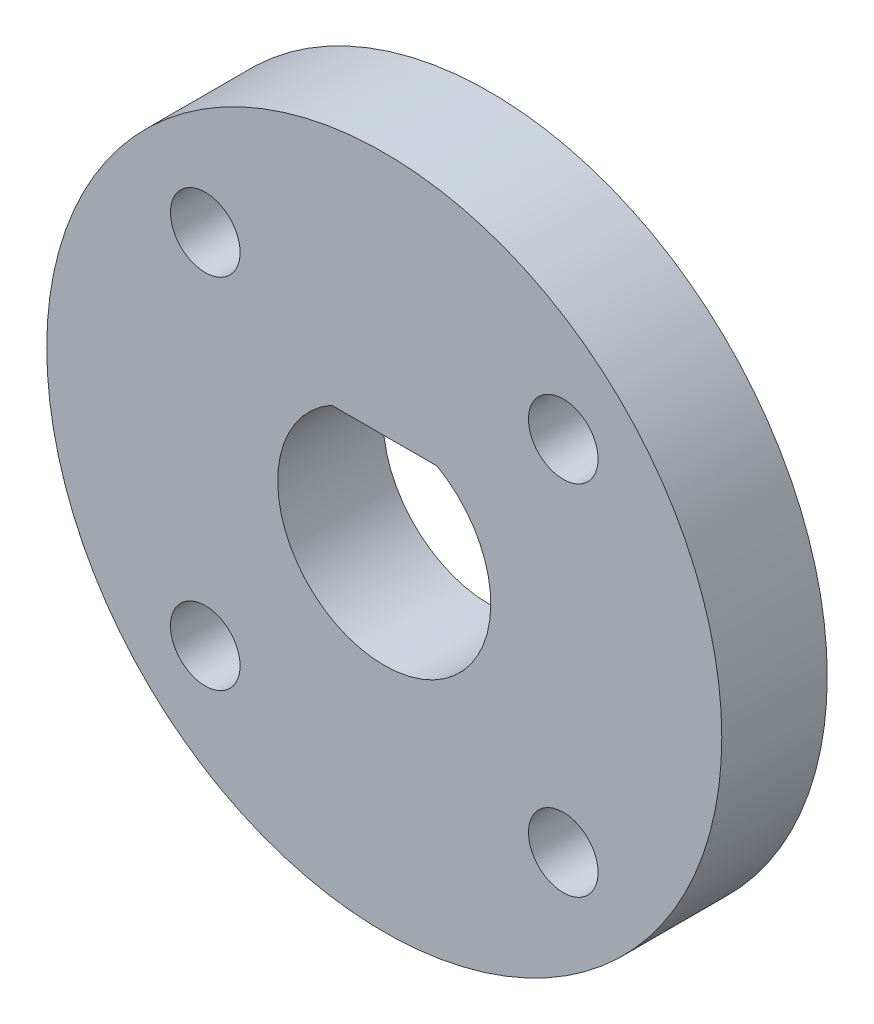
ISO-10303-21;
HEADER;
FILE_DESCRIPTION(('STEP AP214'),'2;1');
FILE_NAME('part.step','',(''),(''),'','','');
FILE_SCHEMA(('AUTOMOTIVE_DESIGN { 1 0 10303 214 1 1 1 1 }'));
ENDSEC;
DATA;
#1=APPLICATION_CONTEXT('core data for automotive mechanical design processes');
#2=APPLICATION_PROTOCOL_DEFINITION('international standard','automotive_design',2000,#1);
#3=PRODUCT_CONTEXT('',#1,'mechanical');
#4=PRODUCT('Part','Part','',(#3));
#5=PRODUCT_RELATED_PRODUCT_CATEGORY('part','',(#4));
#6=PRODUCT_DEFINITION_FORMATION('','',#4);
#7=PRODUCT_DEFINITION_CONTEXT('part definition',#1,'design');
#8=PRODUCT_DEFINITION('design','',#6,#7);
#9=PRODUCT_DEFINITION_SHAPE('','',#8);
#10=(LENGTH_UNIT() NAMED_UNIT(*) SI_UNIT(.MILLI.,.METRE.));
#11=(NAMED_UNIT(*) PLANE_ANGLE_UNIT() SI_UNIT($,.RADIAN.));
#12=(NAMED_UNIT(*) SI_UNIT($,.STERADIAN.) SOLID_ANGLE_UNIT());
#13=UNCERTAINTY_MEASURE_WITH_UNIT(LENGTH_MEASURE(1.E-05),#10,'distance_accuracy_value','');
#14=(GEOMETRIC_REPRESENTATION_CONTEXT(3) GLOBAL_UNCERTAINTY_ASSIGNED_CONTEXT((#13)) GLOBAL_UNIT_ASSIGNED_CONTEXT((#10,
#11,#12)) REPRESENTATION_CONTEXT('',''));
#15=CARTESIAN_POINT('',(0.,0.,0.));
#16=DIRECTION('',(0.,0.,1.));
#17=DIRECTION('',(1.,0.,0.));
#18=AXIS2_PLACEMENT_3D('',#15,#16,#17);
#19=CARTESIAN_POINT('',(0.,0.,2.5));
#20=DIRECTION('',(0.,0.,-1.));
#21=DIRECTION('',(-1.,0.,0.));
#22=AXIS2_PLACEMENT_3D('',#19,#20,#21);
#23=CYLINDRICAL_SURFACE('',#22,5.05);
#24=CARTESIAN_POINT('',(0.,0.,-2.5));
#25=DIRECTION('',(0.,0.,1.));
#26=DIRECTION('',(1.,0.,0.));
#27=AXIS2_PLACEMENT_3D('',#24,#25,#26);
#28=CIRCLE('',#27,5.05);
#29=CARTESIAN_POINT('',(-2.5,4.38776708588776,-2.5));
#30=VERTEX_POINT('',#29);
#31=CARTESIAN_POINT('',(2.5,4.38776708588776,-2.5));
#32=VERTEX_POINT('',#31);
#33=EDGE_CURVE('E80',#30,#32,#28,.T.);
#34=ORIENTED_EDGE('',*,*,#33,.F.);
#35=DIRECTION('',(0.,0.,-1.));
#36=VECTOR('',#35,1.);
#37=CARTESIAN_POINT('',(-2.5,4.38776708588776,2.5));
#38=LINE('',#37,#36);
#39=CARTESIAN_POINT('',(-2.5,4.38776708588776,2.5));
#40=VERTEX_POINT('',#39);
#41=EDGE_CURVE('E12',#40,#30,#38,.T.);
#42=ORIENTED_EDGE('',*,*,#41,.F.);
#43=CARTESIAN_POINT('',(0.,0.,2.5));
#44=DIRECTION('',(0.,0.,1.));
#45=DIRECTION('',(1.,0.,0.));
#46=AXIS2_PLACEMENT_3D('',#43,#44,#45);
#47=CIRCLE('',#46,5.05);
#48=CARTESIAN_POINT('',(2.5,4.38776708588776,2.5));
#49=VERTEX_POINT('',#48);
#50=EDGE_CURVE('E81',#40,#49,#47,.T.);
#51=ORIENTED_EDGE('',*,*,#50,.T.);
#52=DIRECTION('',(0.,0.,-1.));
#53=VECTOR('',#52,1.);
#54=CARTESIAN_POINT('',(2.5,4.38776708588776,2.5));
#55=LINE('',#54,#53);
#56=EDGE_CURVE('E60',#49,#32,#55,.T.);
#57=ORIENTED_EDGE('',*,*,#56,.T.);
#58=EDGE_LOOP('',(#34,#42,#51,#57));
#59=FACE_BOUND('',#58,.T.);
#60=ADVANCED_FACE('F52',(#59),#23,.F.);
#61=CARTESIAN_POINT('',(0.,4.38776708588776,2.5));
#62=DIRECTION('',(0.,1.,0.));
#63=DIRECTION('',(0.,0.,1.));
#64=AXIS2_PLACEMENT_3D('',#61,#62,#63);
#65=PLANE('',#64);
#66=DIRECTION('',(1.,0.,0.));
#67=VECTOR('',#66,1.);
#68=CARTESIAN_POINT('',(0.,4.38776708588776,-2.5));
#69=LINE('',#68,#67);
#70=EDGE_CURVE('E83',#30,#32,#69,.T.);
#71=ORIENTED_EDGE('',*,*,#70,.T.);
#72=ORIENTED_EDGE('',*,*,#56,.F.);
#73=DIRECTION('',(1.,0.,0.));
#74=VECTOR('',#73,1.);
#75=CARTESIAN_POINT('',(0.,4.38776708588776,2.5));
#76=LINE('',#75,#74);
#77=EDGE_CURVE('E67',#40,#49,#76,.T.);
#78=ORIENTED_EDGE('',*,*,#77,.F.);
#79=ORIENTED_EDGE('',*,*,#41,.T.);
#80=EDGE_LOOP('',(#71,#72,#78,#79));
#81=FACE_BOUND('',#80,.T.);
#82=ADVANCED_FACE('F84',(#81),#65,.F.);
#83=CARTESIAN_POINT('',(0.,0.,2.5));
#84=DIRECTION('',(0.,0.,-1.));
#85=DIRECTION('',(-1.,0.,0.));
#86=AXIS2_PLACEMENT_3D('',#83,#84,#85);
#87=CYLINDRICAL_SURFACE('',#86,16.);
#88=CARTESIAN_POINT('',(0.,0.,2.5));
#89=DIRECTION('',(0.,0.,1.));
#90=DIRECTION('',(1.,0.,0.));
#91=AXIS2_PLACEMENT_3D('',#88,#89,#90);
#92=CIRCLE('',#91,16.);
#93=CARTESIAN_POINT('',(16.,0.,2.5));
#94=VERTEX_POINT('',#93);
#95=EDGE_CURVE('E82',#94,#94,#92,.T.);
#96=ORIENTED_EDGE('',*,*,#95,.F.);
#97=EDGE_LOOP('',(#96));
#98=FACE_BOUND('',#97,.T.);
#99=CARTESIAN_POINT('',(0.,0.,-2.5));
#100=DIRECTION('',(0.,0.,1.));
#101=DIRECTION('',(1.,0.,0.));
#102=AXIS2_PLACEMENT_3D('',#99,#100,#101);
#103=CIRCLE('',#102,16.);
#104=CARTESIAN_POINT('',(16.,0.,-2.5));
#105=VERTEX_POINT('',#104);
#106=EDGE_CURVE('E86',#105,#105,#103,.T.);
#107=ORIENTED_EDGE('',*,*,#106,.T.);
#108=EDGE_LOOP('',(#107));
#109=FACE_BOUND('',#108,.T.);
#110=ADVANCED_FACE('F159',(#98,#109),#87,.T.);
#111=CARTESIAN_POINT('',(0.,0.,2.5));
#112=DIRECTION('',(0.,0.,1.));
#113=DIRECTION('',(1.,0.,0.));
#114=AXIS2_PLACEMENT_3D('',#111,#112,#113);
#115=PLANE('',#114);
#116=CARTESIAN_POINT('',(8.48528137423858,8.48528137423856,2.5));
#117=DIRECTION('',(0.,0.,1.));
#118=DIRECTION('',(1.,0.,0.));
#119=AXIS2_PLACEMENT_3D('',#116,#117,#118);
#120=CIRCLE('',#119,1.65);
#121=CARTESIAN_POINT('',(10.1352813742386,8.48528137423856,2.5));
#122=VERTEX_POINT('',#121);
#123=EDGE_CURVE('E134',#122,#122,#120,.T.);
#124=ORIENTED_EDGE('',*,*,#123,.F.);
#125=EDGE_LOOP('',(#124));
#126=FACE_BOUND('',#125,.T.);
#127=CARTESIAN_POINT('',(-8.48528137423856,8.48528137423858,2.5));
#128=DIRECTION('',(0.,0.,1.));
#129=DIRECTION('',(1.,0.,0.));
#130=AXIS2_PLACEMENT_3D('',#127,#128,#129);
#131=CIRCLE('',#130,1.65);
#132=CARTESIAN_POINT('',(-6.83528137423856,8.48528137423858,2.5));
#133=VERTEX_POINT('',#132);
#134=EDGE_CURVE('E126',#133,#133,#131,.T.);
#135=ORIENTED_EDGE('',*,*,#134,.F.);
#136=EDGE_LOOP('',(#135));
#137=FACE_BOUND('',#136,.T.);
#138=CARTESIAN_POINT('',(-8.48528137423859,-8.48528137423856,2.5));
#139=DIRECTION('',(0.,0.,1.));
#140=DIRECTION('',(1.,0.,0.));
#141=AXIS2_PLACEMENT_3D('',#138,#139,#140);
#142=CIRCLE('',#141,1.65);
#143=CARTESIAN_POINT('',(-6.83528137423859,-8.48528137423856,2.5));
#144=VERTEX_POINT('',#143);
#145=EDGE_CURVE('E118',#144,#144,#142,.T.);
#146=ORIENTED_EDGE('',*,*,#145,.F.);
#147=EDGE_LOOP('',(#146));
#148=FACE_BOUND('',#147,.T.);
#149=CARTESIAN_POINT('',(8.48528137423856,-8.48528137423859,2.5));
#150=DIRECTION('',(0.,0.,1.));
#151=DIRECTION('',(1.,0.,0.));
#152=AXIS2_PLACEMENT_3D('',#149,#150,#151);
#153=CIRCLE('',#152,1.65);
#154=CARTESIAN_POINT('',(10.1352813742386,-8.48528137423859,2.5));
#155=VERTEX_POINT('',#154);
#156=EDGE_CURVE('E93',#155,#155,#153,.T.);
#157=ORIENTED_EDGE('',*,*,#156,.F.);
#158=EDGE_LOOP('',(#157));
#159=FACE_BOUND('',#158,.T.);
#160=ORIENTED_EDGE('',*,*,#50,.F.);
#161=ORIENTED_EDGE('',*,*,#77,.T.);
#162=EDGE_LOOP('',(#160,#161));
#163=FACE_BOUND('',#162,.T.);
#164=ORIENTED_EDGE('',*,*,#95,.T.);
#165=EDGE_LOOP('',(#164));
#166=FACE_BOUND('',#165,.T.);
#167=ADVANCED_FACE('F163',(#126,#137,#148,#159,#163,#166),#115,.T.);
#168=CARTESIAN_POINT('',(0.,0.,-2.5));
#169=DIRECTION('',(0.,0.,1.));
#170=DIRECTION('',(1.,0.,0.));
#171=AXIS2_PLACEMENT_3D('',#168,#169,#170);
#172=PLANE('',#171);
#173=CARTESIAN_POINT('',(8.48528137423858,8.48528137423856,-2.5));
#174=DIRECTION('',(0.,0.,1.));
#175=DIRECTION('',(1.,0.,0.));
#176=AXIS2_PLACEMENT_3D('',#173,#174,#175);
#177=CIRCLE('',#176,1.65);
#178=CARTESIAN_POINT('',(10.1352813742386,8.48528137423856,-2.5));
#179=VERTEX_POINT('',#178);
#180=EDGE_CURVE('E131',#179,#179,#177,.T.);
#181=ORIENTED_EDGE('',*,*,#180,.T.);
#182=EDGE_LOOP('',(#181));
#183=FACE_BOUND('',#182,.T.);
#184=CARTESIAN_POINT('',(-8.48528137423856,8.48528137423858,-2.5));
#185=DIRECTION('',(0.,0.,1.));
#186=DIRECTION('',(1.,0.,0.));
#187=AXIS2_PLACEMENT_3D('',#184,#185,#186);
#188=CIRCLE('',#187,1.65);
#189=CARTESIAN_POINT('',(-6.83528137423856,8.48528137423858,-2.5));
#190=VERTEX_POINT('',#189);
#191=EDGE_CURVE('E123',#190,#190,#188,.T.);
#192=ORIENTED_EDGE('',*,*,#191,.T.);
#193=EDGE_LOOP('',(#192));
#194=FACE_BOUND('',#193,.T.);
#195=CARTESIAN_POINT('',(-8.48528137423859,-8.48528137423856,-2.5));
#196=DIRECTION('',(0.,0.,1.));
#197=DIRECTION('',(1.,0.,0.));
#198=AXIS2_PLACEMENT_3D('',#195,#196,#197);
#199=CIRCLE('',#198,1.65);
#200=CARTESIAN_POINT('',(-6.83528137423859,-8.48528137423856,-2.5));
#201=VERTEX_POINT('',#200);
#202=EDGE_CURVE('E116',#201,#201,#199,.T.);
#203=ORIENTED_EDGE('',*,*,#202,.T.);
#204=EDGE_LOOP('',(#203));
#205=FACE_BOUND('',#204,.T.);
#206=CARTESIAN_POINT('',(8.48528137423856,-8.48528137423859,-2.5));
#207=DIRECTION('',(0.,0.,1.));
#208=DIRECTION('',(1.,0.,0.));
#209=AXIS2_PLACEMENT_3D('',#206,#207,#208);
#210=CIRCLE('',#209,1.65);
#211=CARTESIAN_POINT('',(10.1352813742386,-8.48528137423859,-2.5));
#212=VERTEX_POINT('',#211);
#213=EDGE_CURVE('E90',#212,#212,#210,.T.);
#214=ORIENTED_EDGE('',*,*,#213,.T.);
#215=EDGE_LOOP('',(#214));
#216=FACE_BOUND('',#215,.T.);
#217=ORIENTED_EDGE('',*,*,#33,.T.);
#218=ORIENTED_EDGE('',*,*,#70,.F.);
#219=EDGE_LOOP('',(#217,#218));
#220=FACE_BOUND('',#219,.T.);
#221=ORIENTED_EDGE('',*,*,#106,.F.);
#222=EDGE_LOOP('',(#221));
#223=FACE_BOUND('',#222,.T.);
#224=ADVANCED_FACE('F88',(#183,#194,#205,#216,#220,#223),#172,.F.);
#225=CARTESIAN_POINT('',(8.48528137423856,-8.48528137423859,2.5));
#226=DIRECTION('',(0.,0.,1.));
#227=DIRECTION('',(1.,0.,0.));
#228=AXIS2_PLACEMENT_3D('',#225,#226,#227);
#229=CYLINDRICAL_SURFACE('',#228,1.65);
#230=ORIENTED_EDGE('',*,*,#213,.F.);
#231=EDGE_LOOP('',(#230));
#232=FACE_BOUND('',#231,.T.);
#233=ORIENTED_EDGE('',*,*,#156,.T.);
#234=EDGE_LOOP('',(#233));
#235=FACE_BOUND('',#234,.T.);
#236=ADVANCED_FACE('F169',(#232,#235),#229,.F.);
#237=CARTESIAN_POINT('',(-8.48528137423859,-8.48528137423856,2.5));
#238=DIRECTION('',(0.,0.,1.));
#239=DIRECTION('',(1.,0.,0.));
#240=AXIS2_PLACEMENT_3D('',#237,#238,#239);
#241=CYLINDRICAL_SURFACE('',#240,1.65);
#242=ORIENTED_EDGE('',*,*,#202,.F.);
#243=EDGE_LOOP('',(#242));
#244=FACE_BOUND('',#243,.T.);
#245=ORIENTED_EDGE('',*,*,#145,.T.);
#246=EDGE_LOOP('',(#245));
#247=FACE_BOUND('',#246,.T.);
#248=ADVANCED_FACE('F152',(#244,#247),#241,.F.);
#249=CARTESIAN_POINT('',(-8.48528137423856,8.48528137423858,2.5));
#250=DIRECTION('',(0.,0.,1.));
#251=DIRECTION('',(1.,0.,0.));
#252=AXIS2_PLACEMENT_3D('',#249,#250,#251);
#253=CYLINDRICAL_SURFACE('',#252,1.65);
#254=ORIENTED_EDGE('',*,*,#191,.F.);
#255=EDGE_LOOP('',(#254));
#256=FACE_BOUND('',#255,.T.);
#257=ORIENTED_EDGE('',*,*,#134,.T.);
#258=EDGE_LOOP('',(#257));
#259=FACE_BOUND('',#258,.T.);
#260=ADVANCED_FACE('F147',(#256,#259),#253,.F.);
#261=CARTESIAN_POINT('',(8.48528137423858,8.48528137423856,2.5));
#262=DIRECTION('',(0.,0.,1.));
#263=DIRECTION('',(1.,0.,0.));
#264=AXIS2_PLACEMENT_3D('',#261,#262,#263);
#265=CYLINDRICAL_SURFACE('',#264,1.65);
#266=ORIENTED_EDGE('',*,*,#180,.F.);
#267=EDGE_LOOP('',(#266));
#268=FACE_BOUND('',#267,.T.);
#269=ORIENTED_EDGE('',*,*,#123,.T.);
#270=EDGE_LOOP('',(#269));
#271=FACE_BOUND('',#270,.T.);
#272=ADVANCED_FACE('F145',(#268,#271),#265,.F.);
#273=CLOSED_SHELL('',(#60,#82,#110,#167,#224,#236,#248,#260,#272));
#274=MANIFOLD_SOLID_BREP('B2',#273);
#275=ADVANCED_BREP_SHAPE_REPRESENTATION('',(#18,#274),#14);
#276=SHAPE_DEFINITION_REPRESENTATION(#9,#275);
ENDSEC;
END-ISO-10303-21;
